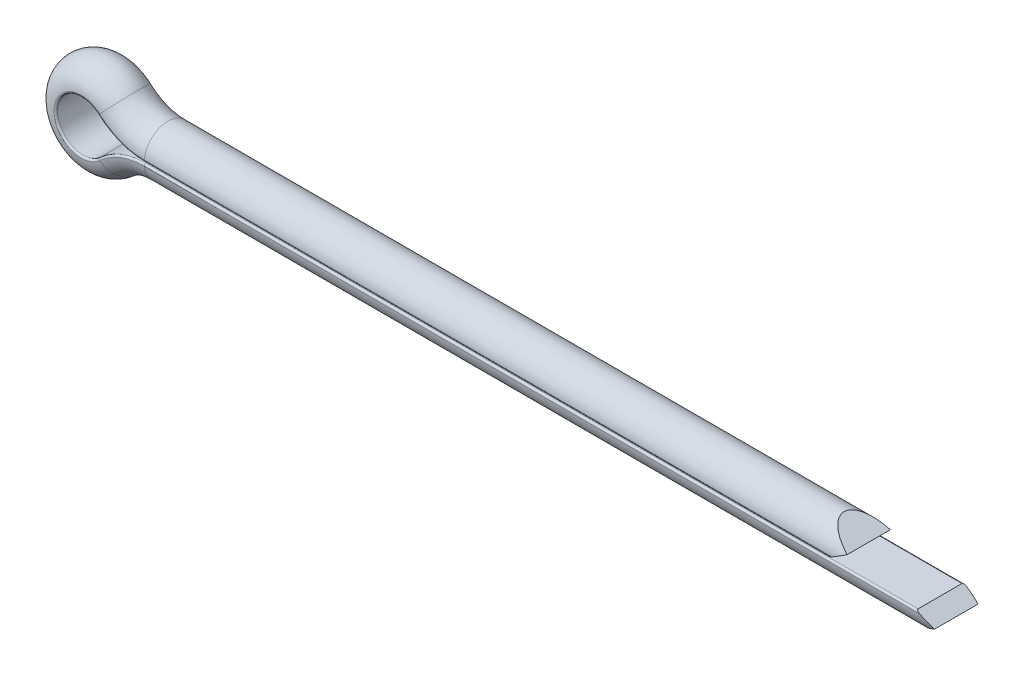
ISO-10303-21;
HEADER;
FILE_DESCRIPTION(('STEP AP214'),'2;1');
FILE_NAME('part.step','',(''),(''),'','','');
FILE_SCHEMA(('AUTOMOTIVE_DESIGN { 1 0 10303 214 1 1 1 1 }'));
ENDSEC;
DATA;
#1=APPLICATION_CONTEXT('core data for automotive mechanical design processes');
#2=APPLICATION_PROTOCOL_DEFINITION('international standard','automotive_design',2000,#1);
#3=PRODUCT_CONTEXT('',#1,'mechanical');
#4=PRODUCT('Part','Part','',(#3));
#5=PRODUCT_RELATED_PRODUCT_CATEGORY('part','',(#4));
#6=PRODUCT_DEFINITION_FORMATION('','',#4);
#7=PRODUCT_DEFINITION_CONTEXT('part definition',#1,'design');
#8=PRODUCT_DEFINITION('design','',#6,#7);
#9=PRODUCT_DEFINITION_SHAPE('','',#8);
#10=(LENGTH_UNIT() NAMED_UNIT(*) SI_UNIT(.MILLI.,.METRE.));
#11=(NAMED_UNIT(*) PLANE_ANGLE_UNIT() SI_UNIT($,.RADIAN.));
#12=(NAMED_UNIT(*) SI_UNIT($,.STERADIAN.) SOLID_ANGLE_UNIT());
#13=UNCERTAINTY_MEASURE_WITH_UNIT(LENGTH_MEASURE(1.E-05),#10,'distance_accuracy_value','');
#14=(GEOMETRIC_REPRESENTATION_CONTEXT(3) GLOBAL_UNCERTAINTY_ASSIGNED_CONTEXT((#13)) GLOBAL_UNIT_ASSIGNED_CONTEXT((#10,
#11,#12)) REPRESENTATION_CONTEXT('',''));
#15=CARTESIAN_POINT('',(0.,0.,0.));
#16=DIRECTION('',(0.,0.,1.));
#17=DIRECTION('',(1.,0.,0.));
#18=AXIS2_PLACEMENT_3D('',#15,#16,#17);
#19=CARTESIAN_POINT('',(21.8,0.0249999999999998,0.));
#20=DIRECTION('',(-1.,0.,0.));
#21=DIRECTION('',(0.,0.,1.));
#22=AXIS2_PLACEMENT_3D('',#19,#20,#21);
#23=CYLINDRICAL_SURFACE('',#22,0.675);
#24=CARTESIAN_POINT('',(1.8,0.0249999999999998,0.));
#25=DIRECTION('',(1.,0.,0.));
#26=DIRECTION('',(0.,0.,1.));
#27=AXIS2_PLACEMENT_3D('',#24,#25,#26);
#28=CIRCLE('',#27,0.675);
#29=CARTESIAN_POINT('',(1.8,0.0789999999999996,-0.672836532896364));
#30=VERTEX_POINT('',#29);
#31=CARTESIAN_POINT('',(1.8,0.0789999999999996,0.672836532896364));
#32=VERTEX_POINT('',#31);
#33=EDGE_CURVE('E173',#30,#32,#28,.T.);
#34=ORIENTED_EDGE('',*,*,#33,.T.);
#35=DIRECTION('',(-1.,0.,0.));
#36=VECTOR('',#35,1.);
#37=CARTESIAN_POINT('',(21.8,0.0789999999999996,0.672836532896364));
#38=LINE('',#37,#36);
#39=CARTESIAN_POINT('',(21.4258770255651,0.0789999999999993,0.672836532896364));
#40=VERTEX_POINT('',#39);
#41=EDGE_CURVE('E51',#32,#40,#38,.F.);
#42=ORIENTED_EDGE('',*,*,#41,.T.);
#43=CARTESIAN_POINT('',(21.3323462819564,0.0249999999999998,0.));
#44=DIRECTION('',(-0.500000000000001,0.866025403784438,0.));
#45=DIRECTION('',(-0.866025403784438,-0.500000000000002,0.));
#46=AXIS2_PLACEMENT_3D('',#43,#44,#45);
#47=ELLIPSE('',#46,1.35,0.675);
#48=CARTESIAN_POINT('',(21.8,0.295,0.618647718819038));
#49=VERTEX_POINT('',#48);
#50=EDGE_CURVE('E172',#40,#49,#47,.T.);
#51=ORIENTED_EDGE('',*,*,#50,.T.);
#52=CARTESIAN_POINT('',(22.2676537180436,0.0249999999999998,0.));
#53=DIRECTION('',(-0.499999999999994,-0.866025403784442,0.));
#54=DIRECTION('',(-0.866025403784442,0.499999999999994,0.));
#55=AXIS2_PLACEMENT_3D('',#52,#53,#54);
#56=ELLIPSE('',#55,1.35000000000002,0.675);
#57=CARTESIAN_POINT('',(21.8,0.295,-0.618647718819039));
#58=VERTEX_POINT('',#57);
#59=EDGE_CURVE('E156',#49,#58,#56,.T.);
#60=ORIENTED_EDGE('',*,*,#59,.T.);
#61=CARTESIAN_POINT('',(21.4258770255651,0.0789999999999993,-0.672836532896364));
#62=VERTEX_POINT('',#61);
#63=EDGE_CURVE('E170',#58,#62,#47,.T.);
#64=ORIENTED_EDGE('',*,*,#63,.T.);
#65=DIRECTION('',(-1.,0.,0.));
#66=VECTOR('',#65,1.);
#67=CARTESIAN_POINT('',(21.8,0.0789999999999996,-0.672836532896364));
#68=LINE('',#67,#66);
#69=EDGE_CURVE('E236',#62,#30,#68,.T.);
#70=ORIENTED_EDGE('',*,*,#69,.T.);
#71=EDGE_LOOP('',(#34,#42,#51,#60,#64,#70));
#72=FACE_BOUND('',#71,.T.);
#73=ADVANCED_FACE('F34',(#72),#23,.T.);
#74=CARTESIAN_POINT('',(21.8,0.0249999999999996,-0.675));
#75=DIRECTION('',(0.,1.,0.));
#76=DIRECTION('',(0.,0.,1.));
#77=AXIS2_PLACEMENT_3D('',#74,#75,#76);
#78=PLANE('',#77);
#79=DIRECTION('',(0.,0.,1.));
#80=VECTOR('',#79,1.);
#81=CARTESIAN_POINT('',(21.3323462819564,0.0249999999999996,-0.675));
#82=LINE('',#81,#80);
#83=CARTESIAN_POINT('',(21.3323462819564,0.0249999999999996,-0.622996789718856));
#84=VERTEX_POINT('',#83);
#85=CARTESIAN_POINT('',(21.3323462819564,0.0249999999999996,0.622996789718855));
#86=VERTEX_POINT('',#85);
#87=EDGE_CURVE('E150',#84,#86,#82,.T.);
#88=ORIENTED_EDGE('',*,*,#87,.T.);
#89=DIRECTION('',(-1.,0.,0.));
#90=VECTOR('',#89,1.);
#91=CARTESIAN_POINT('',(21.8,0.0249999999999996,0.622996789718856));
#92=LINE('',#91,#90);
#93=CARTESIAN_POINT('',(1.8,0.0249999999999996,0.622996789718855));
#94=VERTEX_POINT('',#93);
#95=EDGE_CURVE('E234',#86,#94,#92,.T.);
#96=ORIENTED_EDGE('',*,*,#95,.T.);
#97=DIRECTION('',(0.,0.,-1.));
#98=VECTOR('',#97,1.);
#99=CARTESIAN_POINT('',(1.8,0.0249999999999996,-0.675));
#100=LINE('',#99,#98);
#101=CARTESIAN_POINT('',(1.8,0.0249999999999996,-0.622996789718856));
#102=VERTEX_POINT('',#101);
#103=EDGE_CURVE('E175',#94,#102,#100,.T.);
#104=ORIENTED_EDGE('',*,*,#103,.T.);
#105=DIRECTION('',(-1.,0.,0.));
#106=VECTOR('',#105,1.);
#107=CARTESIAN_POINT('',(21.8,0.0249999999999996,-0.622996789718856));
#108=LINE('',#107,#106);
#109=EDGE_CURVE('E232',#102,#84,#108,.F.);
#110=ORIENTED_EDGE('',*,*,#109,.T.);
#111=EDGE_LOOP('',(#88,#96,#104,#110));
#112=FACE_BOUND('',#111,.T.);
#113=ADVANCED_FACE('F273',(#112),#78,.F.);
#114=CARTESIAN_POINT('',(1.8,1.96428571428572,0.));
#115=DIRECTION('',(0.,0.,-1.));
#116=DIRECTION('',(-1.,0.,0.));
#117=AXIS2_PLACEMENT_3D('',#114,#115,#116);
#118=TOROIDAL_SURFACE('',#117,1.93928571428572,0.675);
#119=CARTESIAN_POINT('',(0.489812332439676,0.534517426273459,0.));
#120=DIRECTION('',(0.737265415549598,-0.675603217158177,0.));
#121=DIRECTION('',(0.,0.,1.));
#122=AXIS2_PLACEMENT_3D('',#119,#120,#121);
#123=CIRCLE('',#122,0.675);
#124=CARTESIAN_POINT('',(0.526294906166815,0.57432975871379,-0.672836532896221));
#125=VERTEX_POINT('',#124);
#126=CARTESIAN_POINT('',(0.526294906166792,0.574329758713765,0.672836532896226));
#127=VERTEX_POINT('',#126);
#128=EDGE_CURVE('E176',#125,#127,#123,.T.);
#129=ORIENTED_EDGE('',*,*,#128,.T.);
#130=CARTESIAN_POINT('',(1.8,1.96428571428572,0.672836532896226));
#131=DIRECTION('',(0.,0.,-1.));
#132=DIRECTION('',(-1.,0.,0.));
#133=AXIS2_PLACEMENT_3D('',#130,#131,#132);
#134=CIRCLE('',#133,1.88528571428573);
#135=EDGE_CURVE('E230',#127,#32,#134,.F.);
#136=ORIENTED_EDGE('',*,*,#135,.T.);
#137=ORIENTED_EDGE('',*,*,#33,.F.);
#138=CARTESIAN_POINT('',(1.8,1.96428571428572,-0.672836532896221));
#139=DIRECTION('',(0.,0.,1.));
#140=DIRECTION('',(1.,0.,0.));
#141=AXIS2_PLACEMENT_3D('',#138,#139,#140);
#142=CIRCLE('',#141,1.88528571428573);
#143=EDGE_CURVE('E228',#30,#125,#142,.F.);
#144=ORIENTED_EDGE('',*,*,#143,.T.);
#145=EDGE_LOOP('',(#129,#136,#137,#144));
#146=FACE_BOUND('',#145,.T.);
#147=ADVANCED_FACE('F350',(#146),#118,.T.);
#148=CARTESIAN_POINT('',(1.8,1.96428571428572,0.));
#149=DIRECTION('',(0.,0.,-1.));
#150=DIRECTION('',(-1.,0.,0.));
#151=AXIS2_PLACEMENT_3D('',#148,#149,#150);
#152=CYLINDRICAL_SURFACE('',#151,1.93928571428572);
#153=ORIENTED_EDGE('',*,*,#103,.F.);
#154=CARTESIAN_POINT('',(1.8,1.96428571428572,0.622996789718856));
#155=DIRECTION('',(0.,0.,1.));
#156=DIRECTION('',(1.,0.,0.));
#157=AXIS2_PLACEMENT_3D('',#154,#155,#156);
#158=CIRCLE('',#157,1.93928571428572);
#159=CARTESIAN_POINT('',(0.489812332439676,0.534517426273459,0.622996789718855));
#160=VERTEX_POINT('',#159);
#161=EDGE_CURVE('E226',#94,#160,#158,.F.);
#162=ORIENTED_EDGE('',*,*,#161,.T.);
#163=DIRECTION('',(0.,0.,-1.));
#164=VECTOR('',#163,1.);
#165=CARTESIAN_POINT('',(0.489812332439676,0.534517426273459,-0.675));
#166=LINE('',#165,#164);
#167=CARTESIAN_POINT('',(0.489812332439676,0.534517426273459,-0.622996789718856));
#168=VERTEX_POINT('',#167);
#169=EDGE_CURVE('E179',#160,#168,#166,.T.);
#170=ORIENTED_EDGE('',*,*,#169,.T.);
#171=CARTESIAN_POINT('',(1.8,1.96428571428572,-0.622996789718856));
#172=DIRECTION('',(0.,0.,1.));
#173=DIRECTION('',(1.,0.,0.));
#174=AXIS2_PLACEMENT_3D('',#171,#172,#173);
#175=CIRCLE('',#174,1.93928571428572);
#176=EDGE_CURVE('E224',#168,#102,#175,.T.);
#177=ORIENTED_EDGE('',*,*,#176,.T.);
#178=EDGE_LOOP('',(#153,#162,#170,#177));
#179=FACE_BOUND('',#178,.T.);
#180=ADVANCED_FACE('F283',(#179),#152,.T.);
#181=CARTESIAN_POINT('',(0.,0.,0.));
#182=DIRECTION('',(0.,0.,1.));
#183=DIRECTION('',(1.,0.,0.));
#184=AXIS2_PLACEMENT_3D('',#181,#182,#183);
#185=TOROIDAL_SURFACE('',#184,0.725,0.675);
#186=CARTESIAN_POINT('',(0.489812332439676,-0.534517426273459,0.));
#187=DIRECTION('',(-0.737265415549598,-0.675603217158177,0.));
#188=DIRECTION('',(0.,0.,1.));
#189=AXIS2_PLACEMENT_3D('',#186,#187,#188);
#190=CIRCLE('',#189,0.675);
#191=CARTESIAN_POINT('',(0.526294906166266,-0.574329758713191,-0.672836532896352));
#192=VERTEX_POINT('',#191);
#193=CARTESIAN_POINT('',(0.526294906166212,-0.574329758713132,0.672836532896365));
#194=VERTEX_POINT('',#193);
#195=EDGE_CURVE('E180',#192,#194,#190,.T.);
#196=ORIENTED_EDGE('',*,*,#195,.T.);
#197=CARTESIAN_POINT('',(0.,0.,0.672836532896365));
#198=DIRECTION('',(0.,0.,-1.));
#199=DIRECTION('',(-1.,0.,0.));
#200=AXIS2_PLACEMENT_3D('',#197,#198,#199);
#201=CIRCLE('',#200,0.779);
#202=EDGE_CURVE('E222',#194,#127,#201,.T.);
#203=ORIENTED_EDGE('',*,*,#202,.T.);
#204=ORIENTED_EDGE('',*,*,#128,.F.);
#205=CARTESIAN_POINT('',(0.,0.,-0.672836532896352));
#206=DIRECTION('',(0.,0.,1.));
#207=DIRECTION('',(1.,0.,0.));
#208=AXIS2_PLACEMENT_3D('',#205,#206,#207);
#209=CIRCLE('',#208,0.778999999999999);
#210=EDGE_CURVE('E220',#125,#192,#209,.T.);
#211=ORIENTED_EDGE('',*,*,#210,.T.);
#212=EDGE_LOOP('',(#196,#203,#204,#211));
#213=FACE_BOUND('',#212,.T.);
#214=ADVANCED_FACE('F322',(#213),#185,.T.);
#215=CARTESIAN_POINT('',(0.,0.,0.));
#216=DIRECTION('',(0.,0.,1.));
#217=DIRECTION('',(1.,0.,0.));
#218=AXIS2_PLACEMENT_3D('',#215,#216,#217);
#219=CYLINDRICAL_SURFACE('',#218,0.725);
#220=ORIENTED_EDGE('',*,*,#169,.F.);
#221=CARTESIAN_POINT('',(0.,0.,0.622996789718856));
#222=DIRECTION('',(0.,0.,-1.));
#223=DIRECTION('',(-1.,0.,0.));
#224=AXIS2_PLACEMENT_3D('',#221,#222,#223);
#225=CIRCLE('',#224,0.725);
#226=CARTESIAN_POINT('',(0.489812332439676,-0.534517426273459,0.622996789718855));
#227=VERTEX_POINT('',#226);
#228=EDGE_CURVE('E218',#160,#227,#225,.F.);
#229=ORIENTED_EDGE('',*,*,#228,.T.);
#230=DIRECTION('',(0.,0.,-1.));
#231=VECTOR('',#230,1.);
#232=CARTESIAN_POINT('',(0.489812332439676,-0.534517426273459,-0.675));
#233=LINE('',#232,#231);
#234=CARTESIAN_POINT('',(0.489812332439676,-0.534517426273459,-0.622996789718856));
#235=VERTEX_POINT('',#234);
#236=EDGE_CURVE('E183',#227,#235,#233,.T.);
#237=ORIENTED_EDGE('',*,*,#236,.T.);
#238=CARTESIAN_POINT('',(0.,0.,-0.622996789718856));
#239=DIRECTION('',(0.,0.,-1.));
#240=DIRECTION('',(-1.,0.,0.));
#241=AXIS2_PLACEMENT_3D('',#238,#239,#240);
#242=CIRCLE('',#241,0.725);
#243=EDGE_CURVE('E216',#235,#168,#242,.T.);
#244=ORIENTED_EDGE('',*,*,#243,.T.);
#245=EDGE_LOOP('',(#220,#229,#237,#244));
#246=FACE_BOUND('',#245,.T.);
#247=ADVANCED_FACE('F287',(#246),#219,.F.);
#248=CARTESIAN_POINT('',(1.8,-1.96428571428572,0.));
#249=DIRECTION('',(0.,0.,-1.));
#250=DIRECTION('',(-1.,0.,0.));
#251=AXIS2_PLACEMENT_3D('',#248,#249,#250);
#252=TOROIDAL_SURFACE('',#251,1.93928571428572,0.675);
#253=CARTESIAN_POINT('',(1.8,-0.0249999999999998,0.));
#254=DIRECTION('',(-1.,0.,0.));
#255=DIRECTION('',(0.,0.,1.));
#256=AXIS2_PLACEMENT_3D('',#253,#254,#255);
#257=CIRCLE('',#256,0.675);
#258=CARTESIAN_POINT('',(1.8,-0.0790000000008683,-0.672836532896224));
#259=VERTEX_POINT('',#258);
#260=CARTESIAN_POINT('',(1.8,-0.0790000000013898,0.672836532896139));
#261=VERTEX_POINT('',#260);
#262=EDGE_CURVE('E184',#259,#261,#257,.T.);
#263=ORIENTED_EDGE('',*,*,#262,.T.);
#264=CARTESIAN_POINT('',(1.8,-1.96428571428572,0.672836532896139));
#265=DIRECTION('',(0.,0.,-1.));
#266=DIRECTION('',(-1.,0.,0.));
#267=AXIS2_PLACEMENT_3D('',#264,#265,#266);
#268=CIRCLE('',#267,1.88528571428573);
#269=EDGE_CURVE('E214',#261,#194,#268,.F.);
#270=ORIENTED_EDGE('',*,*,#269,.T.);
#271=ORIENTED_EDGE('',*,*,#195,.F.);
#272=CARTESIAN_POINT('',(1.8,-1.96428571428572,-0.672836532896224));
#273=DIRECTION('',(0.,0.,1.));
#274=DIRECTION('',(1.,0.,0.));
#275=AXIS2_PLACEMENT_3D('',#272,#273,#274);
#276=CIRCLE('',#275,1.88528571428573);
#277=EDGE_CURVE('E212',#192,#259,#276,.F.);
#278=ORIENTED_EDGE('',*,*,#277,.T.);
#279=EDGE_LOOP('',(#263,#270,#271,#278));
#280=FACE_BOUND('',#279,.T.);
#281=ADVANCED_FACE('F324',(#280),#252,.T.);
#282=CARTESIAN_POINT('',(1.8,-1.96428571428572,0.));
#283=DIRECTION('',(0.,0.,-1.));
#284=DIRECTION('',(-1.,0.,0.));
#285=AXIS2_PLACEMENT_3D('',#282,#283,#284);
#286=CYLINDRICAL_SURFACE('',#285,1.93928571428572);
#287=ORIENTED_EDGE('',*,*,#236,.F.);
#288=CARTESIAN_POINT('',(1.8,-1.96428571428572,0.622996789718856));
#289=DIRECTION('',(0.,0.,1.));
#290=DIRECTION('',(1.,0.,0.));
#291=AXIS2_PLACEMENT_3D('',#288,#289,#290);
#292=CIRCLE('',#291,1.93928571428572);
#293=CARTESIAN_POINT('',(1.8,-0.0249999999999996,0.622996789718855));
#294=VERTEX_POINT('',#293);
#295=EDGE_CURVE('E210',#227,#294,#292,.F.);
#296=ORIENTED_EDGE('',*,*,#295,.T.);
#297=DIRECTION('',(0.,0.,-1.));
#298=VECTOR('',#297,1.);
#299=CARTESIAN_POINT('',(1.8,-0.0249999999999996,-0.675));
#300=LINE('',#299,#298);
#301=CARTESIAN_POINT('',(1.8,-0.0249999999999996,-0.622996789718856));
#302=VERTEX_POINT('',#301);
#303=EDGE_CURVE('E157',#294,#302,#300,.T.);
#304=ORIENTED_EDGE('',*,*,#303,.T.);
#305=CARTESIAN_POINT('',(1.8,-1.96428571428572,-0.622996789718856));
#306=DIRECTION('',(0.,0.,1.));
#307=DIRECTION('',(1.,0.,0.));
#308=AXIS2_PLACEMENT_3D('',#305,#306,#307);
#309=CIRCLE('',#308,1.93928571428572);
#310=EDGE_CURVE('E208',#302,#235,#309,.T.);
#311=ORIENTED_EDGE('',*,*,#310,.T.);
#312=EDGE_LOOP('',(#287,#296,#304,#311));
#313=FACE_BOUND('',#312,.T.);
#314=ADVANCED_FACE('F305',(#313),#286,.T.);
#315=CARTESIAN_POINT('',(1.8,-0.0249999999999998,0.));
#316=DIRECTION('',(1.,0.,0.));
#317=DIRECTION('',(0.,0.,-1.));
#318=AXIS2_PLACEMENT_3D('',#315,#316,#317);
#319=CYLINDRICAL_SURFACE('',#318,0.675);
#320=CARTESIAN_POINT('',(23.8323462819564,-0.0249999999999998,0.));
#321=DIRECTION('',(-0.500000000000002,-0.866025403784438,0.));
#322=DIRECTION('',(0.866025403784438,-0.500000000000002,0.));
#323=AXIS2_PLACEMENT_3D('',#320,#321,#322);
#324=ELLIPSE('',#323,1.35,0.675);
#325=CARTESIAN_POINT('',(24.3,-0.294999999999999,0.618647718819039));
#326=VERTEX_POINT('',#325);
#327=CARTESIAN_POINT('',(23.9258770255651,-0.0789999999999992,0.672836532896364));
#328=VERTEX_POINT('',#327);
#329=EDGE_CURVE('E149',#326,#328,#324,.T.);
#330=ORIENTED_EDGE('',*,*,#329,.T.);
#331=DIRECTION('',(1.,0.,0.));
#332=VECTOR('',#331,1.);
#333=CARTESIAN_POINT('',(1.8,-0.0789999999999996,0.672836532896364));
#334=LINE('',#333,#332);
#335=EDGE_CURVE('E206',#328,#261,#334,.F.);
#336=ORIENTED_EDGE('',*,*,#335,.T.);
#337=ORIENTED_EDGE('',*,*,#262,.F.);
#338=DIRECTION('',(1.,0.,0.));
#339=VECTOR('',#338,1.);
#340=CARTESIAN_POINT('',(1.8,-0.0789999999999996,-0.672836532896364));
#341=LINE('',#340,#339);
#342=CARTESIAN_POINT('',(23.9258770255651,-0.078999999999999,-0.672836532896364));
#343=VERTEX_POINT('',#342);
#344=EDGE_CURVE('E146',#259,#343,#341,.T.);
#345=ORIENTED_EDGE('',*,*,#344,.T.);
#346=CARTESIAN_POINT('',(24.3,-0.294999999999999,-0.618647718819039));
#347=VERTEX_POINT('',#346);
#348=EDGE_CURVE('E138',#343,#347,#324,.T.);
#349=ORIENTED_EDGE('',*,*,#348,.T.);
#350=CARTESIAN_POINT('',(24.7676537180436,-0.0249999999999998,0.));
#351=DIRECTION('',(-0.499999999999994,0.866025403784442,0.));
#352=DIRECTION('',(0.866025403784442,0.499999999999994,0.));
#353=AXIS2_PLACEMENT_3D('',#350,#351,#352);
#354=ELLIPSE('',#353,1.35000000000002,0.675);
#355=EDGE_CURVE('E142',#347,#326,#354,.T.);
#356=ORIENTED_EDGE('',*,*,#355,.T.);
#357=EDGE_LOOP('',(#330,#336,#337,#345,#349,#356));
#358=FACE_BOUND('',#357,.T.);
#359=ADVANCED_FACE('F141',(#358),#319,.T.);
#360=CARTESIAN_POINT('',(1.8,-0.0249999999999996,-0.675));
#361=DIRECTION('',(0.,-1.,0.));
#362=DIRECTION('',(0.,0.,-1.));
#363=AXIS2_PLACEMENT_3D('',#360,#361,#362);
#364=PLANE('',#363);
#365=ORIENTED_EDGE('',*,*,#303,.F.);
#366=DIRECTION('',(1.,0.,0.));
#367=VECTOR('',#366,1.);
#368=CARTESIAN_POINT('',(1.8,-0.0249999999999996,0.622996789718855));
#369=LINE('',#368,#367);
#370=CARTESIAN_POINT('',(23.8323462819564,-0.0249999999999994,0.622996789718855));
#371=VERTEX_POINT('',#370);
#372=EDGE_CURVE('E198',#294,#371,#369,.T.);
#373=ORIENTED_EDGE('',*,*,#372,.T.);
#374=DIRECTION('',(0.,0.,1.));
#375=VECTOR('',#374,1.);
#376=CARTESIAN_POINT('',(23.8323462819564,-0.0249999999999994,-0.675));
#377=LINE('',#376,#375);
#378=CARTESIAN_POINT('',(23.8323462819564,-0.0249999999999994,-0.622996789718856));
#379=VERTEX_POINT('',#378);
#380=EDGE_CURVE('E162',#379,#371,#377,.T.);
#381=ORIENTED_EDGE('',*,*,#380,.F.);
#382=DIRECTION('',(1.,0.,0.));
#383=VECTOR('',#382,1.);
#384=CARTESIAN_POINT('',(1.8,-0.0249999999999996,-0.622996789718856));
#385=LINE('',#384,#383);
#386=EDGE_CURVE('E196',#379,#302,#385,.F.);
#387=ORIENTED_EDGE('',*,*,#386,.T.);
#388=EDGE_LOOP('',(#365,#373,#381,#387));
#389=FACE_BOUND('',#388,.T.);
#390=ADVANCED_FACE('F308',(#389),#364,.F.);
#391=CARTESIAN_POINT('',(24.3,-0.294999999999999,-0.675));
#392=DIRECTION('',(-0.500000000000002,-0.866025403784438,0.));
#393=DIRECTION('',(0.866025403784438,-0.500000000000002,0.));
#394=AXIS2_PLACEMENT_3D('',#391,#392,#393);
#395=PLANE('',#394);
#396=ORIENTED_EDGE('',*,*,#380,.T.);
#397=CARTESIAN_POINT('',(23.9189488223348,-0.0749999999999996,0.622996789718856));
#398=DIRECTION('',(-0.500000000000002,-0.866025403784438,0.));
#399=DIRECTION('',(0.866025403784438,-0.500000000000002,0.));
#400=AXIS2_PLACEMENT_3D('',#397,#398,#399);
#401=ELLIPSE('',#400,0.0999999999999997,0.05);
#402=EDGE_CURVE('E203',#371,#328,#401,.F.);
#403=ORIENTED_EDGE('',*,*,#402,.T.);
#404=ORIENTED_EDGE('',*,*,#329,.F.);
#405=DIRECTION('',(0.,0.,1.));
#406=VECTOR('',#405,1.);
#407=CARTESIAN_POINT('',(24.3,-0.294999999999999,-0.675));
#408=LINE('',#407,#406);
#409=EDGE_CURVE('E155',#347,#326,#408,.T.);
#410=ORIENTED_EDGE('',*,*,#409,.F.);
#411=ORIENTED_EDGE('',*,*,#348,.F.);
#412=CARTESIAN_POINT('',(23.9189488223348,-0.0749999999999996,-0.622996789718856));
#413=DIRECTION('',(-0.500000000000002,-0.866025403784438,0.));
#414=DIRECTION('',(0.866025403784438,-0.500000000000002,0.));
#415=AXIS2_PLACEMENT_3D('',#412,#413,#414);
#416=ELLIPSE('',#415,0.0999999999999997,0.05);
#417=EDGE_CURVE('E201',#343,#379,#416,.F.);
#418=ORIENTED_EDGE('',*,*,#417,.T.);
#419=EDGE_LOOP('',(#396,#403,#404,#410,#411,#418));
#420=FACE_BOUND('',#419,.T.);
#421=ADVANCED_FACE('F160',(#420),#395,.F.);
#422=CARTESIAN_POINT('',(23.5985194229346,-0.7,-0.675));
#423=DIRECTION('',(-0.499999999999994,0.866025403784442,0.));
#424=DIRECTION('',(-0.866025403784442,-0.499999999999994,0.));
#425=AXIS2_PLACEMENT_3D('',#422,#423,#424);
#426=PLANE('',#425);
#427=ORIENTED_EDGE('',*,*,#409,.T.);
#428=ORIENTED_EDGE('',*,*,#355,.F.);
#429=EDGE_LOOP('',(#427,#428));
#430=FACE_BOUND('',#429,.T.);
#431=ADVANCED_FACE('F154',(#430),#426,.F.);
#432=CARTESIAN_POINT('',(21.8,0.295,-0.675));
#433=DIRECTION('',(-0.499999999999994,-0.866025403784442,0.));
#434=DIRECTION('',(0.866025403784442,-0.499999999999994,0.));
#435=AXIS2_PLACEMENT_3D('',#432,#433,#434);
#436=PLANE('',#435);
#437=ORIENTED_EDGE('',*,*,#59,.F.);
#438=DIRECTION('',(0.,0.,1.));
#439=VECTOR('',#438,1.);
#440=CARTESIAN_POINT('',(21.8,0.295,-0.675));
#441=LINE('',#440,#439);
#442=EDGE_CURVE('E161',#58,#49,#441,.T.);
#443=ORIENTED_EDGE('',*,*,#442,.F.);
#444=EDGE_LOOP('',(#437,#443));
#445=FACE_BOUND('',#444,.T.);
#446=ADVANCED_FACE('F364',(#445),#436,.F.);
#447=CARTESIAN_POINT('',(21.3323462819564,0.0249999999999996,-0.675));
#448=DIRECTION('',(-0.500000000000001,0.866025403784438,0.));
#449=DIRECTION('',(-0.866025403784438,-0.500000000000002,0.));
#450=AXIS2_PLACEMENT_3D('',#447,#448,#449);
#451=PLANE('',#450);
#452=ORIENTED_EDGE('',*,*,#50,.F.);
#453=CARTESIAN_POINT('',(21.4189488223349,0.0749999999999996,0.622996789718856));
#454=DIRECTION('',(-0.500000000000001,0.866025403784438,0.));
#455=DIRECTION('',(-0.866025403784438,-0.500000000000002,0.));
#456=AXIS2_PLACEMENT_3D('',#453,#454,#455);
#457=ELLIPSE('',#456,0.0999999999999997,0.05);
#458=EDGE_CURVE('E11',#40,#86,#457,.F.);
#459=ORIENTED_EDGE('',*,*,#458,.T.);
#460=ORIENTED_EDGE('',*,*,#87,.F.);
#461=CARTESIAN_POINT('',(21.4189488223349,0.0749999999999996,-0.622996789718856));
#462=DIRECTION('',(-0.500000000000001,0.866025403784438,0.));
#463=DIRECTION('',(-0.866025403784438,-0.500000000000002,0.));
#464=AXIS2_PLACEMENT_3D('',#461,#462,#463);
#465=ELLIPSE('',#464,0.0999999999999997,0.05);
#466=EDGE_CURVE('E43',#84,#62,#465,.F.);
#467=ORIENTED_EDGE('',*,*,#466,.T.);
#468=ORIENTED_EDGE('',*,*,#63,.F.);
#469=ORIENTED_EDGE('',*,*,#442,.T.);
#470=EDGE_LOOP('',(#452,#459,#460,#467,#468,#469));
#471=FACE_BOUND('',#470,.T.);
#472=ADVANCED_FACE('F276',(#471),#451,.F.);
#473=CARTESIAN_POINT('',(21.8,0.0749999999999996,0.622996789718856));
#474=DIRECTION('',(-1.,0.,0.));
#475=DIRECTION('',(0.,0.,1.));
#476=AXIS2_PLACEMENT_3D('',#473,#474,#475);
#477=CYLINDRICAL_SURFACE('',#476,0.05);
#478=ORIENTED_EDGE('',*,*,#458,.F.);
#479=ORIENTED_EDGE('',*,*,#41,.F.);
#480=CARTESIAN_POINT('',(1.8,0.0749999999999996,0.622996789718856));
#481=DIRECTION('',(-1.,0.,0.));
#482=DIRECTION('',(0.,0.,1.));
#483=AXIS2_PLACEMENT_3D('',#480,#481,#482);
#484=CIRCLE('',#483,0.05);
#485=EDGE_CURVE('E166',#94,#32,#484,.T.);
#486=ORIENTED_EDGE('',*,*,#485,.F.);
#487=ORIENTED_EDGE('',*,*,#95,.F.);
#488=EDGE_LOOP('',(#478,#479,#486,#487));
#489=FACE_BOUND('',#488,.T.);
#490=ADVANCED_FACE('F279',(#489),#477,.T.);
#491=CARTESIAN_POINT('',(1.8,1.96428571428572,0.622996789718856));
#492=DIRECTION('',(0.,0.,1.));
#493=DIRECTION('',(1.,0.,0.));
#494=AXIS2_PLACEMENT_3D('',#491,#492,#493);
#495=TOROIDAL_SURFACE('',#494,1.88928571428572,0.05);
#496=ORIENTED_EDGE('',*,*,#485,.T.);
#497=ORIENTED_EDGE('',*,*,#135,.F.);
#498=CARTESIAN_POINT('',(0.523592493297583,0.571380697050937,0.622996789718856));
#499=DIRECTION('',(-0.737265415549598,0.675603217158177,0.));
#500=DIRECTION('',(-0.675603217158177,-0.737265415549598,0.));
#501=AXIS2_PLACEMENT_3D('',#498,#499,#500);
#502=CIRCLE('',#501,0.05);
#503=EDGE_CURVE('E246',#160,#127,#502,.T.);
#504=ORIENTED_EDGE('',*,*,#503,.F.);
#505=ORIENTED_EDGE('',*,*,#161,.F.);
#506=EDGE_LOOP('',(#496,#497,#504,#505));
#507=FACE_BOUND('',#506,.T.);
#508=ADVANCED_FACE('F292',(#507),#495,.T.);
#509=CARTESIAN_POINT('',(0.,0.,0.622996789718856));
#510=DIRECTION('',(0.,0.,-1.));
#511=DIRECTION('',(-1.,0.,0.));
#512=AXIS2_PLACEMENT_3D('',#509,#510,#511);
#513=TOROIDAL_SURFACE('',#512,0.775,0.05);
#514=ORIENTED_EDGE('',*,*,#503,.T.);
#515=ORIENTED_EDGE('',*,*,#202,.F.);
#516=CARTESIAN_POINT('',(0.523592493297585,-0.57138069705094,0.622996789718856));
#517=DIRECTION('',(0.7372654155496,0.675603217158175,0.));
#518=DIRECTION('',(-0.675603217158175,0.7372654155496,0.));
#519=AXIS2_PLACEMENT_3D('',#516,#517,#518);
#520=CIRCLE('',#519,0.05);
#521=EDGE_CURVE('E243',#227,#194,#520,.T.);
#522=ORIENTED_EDGE('',*,*,#521,.F.);
#523=ORIENTED_EDGE('',*,*,#228,.F.);
#524=EDGE_LOOP('',(#514,#515,#522,#523));
#525=FACE_BOUND('',#524,.T.);
#526=ADVANCED_FACE('F296',(#525),#513,.T.);
#527=CARTESIAN_POINT('',(1.8,-1.96428571428572,0.622996789718856));
#528=DIRECTION('',(0.,0.,1.));
#529=DIRECTION('',(1.,0.,0.));
#530=AXIS2_PLACEMENT_3D('',#527,#528,#529);
#531=TOROIDAL_SURFACE('',#530,1.88928571428572,0.05);
#532=ORIENTED_EDGE('',*,*,#521,.T.);
#533=ORIENTED_EDGE('',*,*,#269,.F.);
#534=CARTESIAN_POINT('',(1.8,-0.0749999999999988,0.622996789718856));
#535=DIRECTION('',(1.,0.,0.));
#536=DIRECTION('',(0.,0.,-1.));
#537=AXIS2_PLACEMENT_3D('',#534,#535,#536);
#538=CIRCLE('',#537,0.05);
#539=EDGE_CURVE('E240',#294,#261,#538,.T.);
#540=ORIENTED_EDGE('',*,*,#539,.F.);
#541=ORIENTED_EDGE('',*,*,#295,.F.);
#542=EDGE_LOOP('',(#532,#533,#540,#541));
#543=FACE_BOUND('',#542,.T.);
#544=ADVANCED_FACE('F301',(#543),#531,.T.);
#545=CARTESIAN_POINT('',(1.8,-0.0749999999999996,0.622996789718856));
#546=DIRECTION('',(1.,0.,0.));
#547=DIRECTION('',(0.,0.,-1.));
#548=AXIS2_PLACEMENT_3D('',#545,#546,#547);
#549=CYLINDRICAL_SURFACE('',#548,0.05);
#550=ORIENTED_EDGE('',*,*,#539,.T.);
#551=ORIENTED_EDGE('',*,*,#335,.F.);
#552=ORIENTED_EDGE('',*,*,#402,.F.);
#553=ORIENTED_EDGE('',*,*,#372,.F.);
#554=EDGE_LOOP('',(#550,#551,#552,#553));
#555=FACE_BOUND('',#554,.T.);
#556=ADVANCED_FACE('F327',(#555),#549,.T.);
#557=CARTESIAN_POINT('',(21.8,0.0749999999999996,-0.622996789718856));
#558=DIRECTION('',(-1.,0.,0.));
#559=DIRECTION('',(0.,0.,1.));
#560=AXIS2_PLACEMENT_3D('',#557,#558,#559);
#561=CYLINDRICAL_SURFACE('',#560,0.05);
#562=ORIENTED_EDGE('',*,*,#466,.F.);
#563=ORIENTED_EDGE('',*,*,#109,.F.);
#564=CARTESIAN_POINT('',(1.8,0.0749999999999996,-0.622996789718856));
#565=DIRECTION('',(-1.,0.,0.));
#566=DIRECTION('',(0.,0.,1.));
#567=AXIS2_PLACEMENT_3D('',#564,#565,#566);
#568=CIRCLE('',#567,0.05);
#569=EDGE_CURVE('E38',#30,#102,#568,.T.);
#570=ORIENTED_EDGE('',*,*,#569,.F.);
#571=ORIENTED_EDGE('',*,*,#69,.F.);
#572=EDGE_LOOP('',(#562,#563,#570,#571));
#573=FACE_BOUND('',#572,.T.);
#574=ADVANCED_FACE('F36',(#573),#561,.T.);
#575=CARTESIAN_POINT('',(1.8,1.96428571428572,-0.622996789718856));
#576=DIRECTION('',(0.,0.,1.));
#577=DIRECTION('',(1.,0.,0.));
#578=AXIS2_PLACEMENT_3D('',#575,#576,#577);
#579=TOROIDAL_SURFACE('',#578,1.88928571428572,0.05);
#580=ORIENTED_EDGE('',*,*,#569,.T.);
#581=ORIENTED_EDGE('',*,*,#176,.F.);
#582=CARTESIAN_POINT('',(0.523592493297583,0.571380697050937,-0.622996789718856));
#583=DIRECTION('',(-0.737265415549597,0.675603217158177,0.));
#584=DIRECTION('',(-0.675603217158177,-0.737265415549597,0.));
#585=AXIS2_PLACEMENT_3D('',#582,#583,#584);
#586=CIRCLE('',#585,0.05);
#587=EDGE_CURVE('E256',#125,#168,#586,.T.);
#588=ORIENTED_EDGE('',*,*,#587,.F.);
#589=ORIENTED_EDGE('',*,*,#143,.F.);
#590=EDGE_LOOP('',(#580,#581,#588,#589));
#591=FACE_BOUND('',#590,.T.);
#592=ADVANCED_FACE('F267',(#591),#579,.T.);
#593=CARTESIAN_POINT('',(0.,0.,-0.622996789718856));
#594=DIRECTION('',(0.,0.,-1.));
#595=DIRECTION('',(-1.,0.,0.));
#596=AXIS2_PLACEMENT_3D('',#593,#594,#595);
#597=TOROIDAL_SURFACE('',#596,0.775,0.05);
#598=ORIENTED_EDGE('',*,*,#587,.T.);
#599=ORIENTED_EDGE('',*,*,#243,.F.);
#600=CARTESIAN_POINT('',(0.523592493297585,-0.57138069705094,-0.622996789718856));
#601=DIRECTION('',(0.737265415549599,0.675603217158176,0.));
#602=DIRECTION('',(-0.675603217158176,0.737265415549599,0.));
#603=AXIS2_PLACEMENT_3D('',#600,#601,#602);
#604=CIRCLE('',#603,0.05);
#605=EDGE_CURVE('E254',#192,#235,#604,.T.);
#606=ORIENTED_EDGE('',*,*,#605,.F.);
#607=ORIENTED_EDGE('',*,*,#210,.F.);
#608=EDGE_LOOP('',(#598,#599,#606,#607));
#609=FACE_BOUND('',#608,.T.);
#610=ADVANCED_FACE('F318',(#609),#597,.T.);
#611=CARTESIAN_POINT('',(1.8,-1.96428571428572,-0.622996789718856));
#612=DIRECTION('',(0.,0.,1.));
#613=DIRECTION('',(1.,0.,0.));
#614=AXIS2_PLACEMENT_3D('',#611,#612,#613);
#615=TOROIDAL_SURFACE('',#614,1.88928571428572,0.05);
#616=ORIENTED_EDGE('',*,*,#605,.T.);
#617=ORIENTED_EDGE('',*,*,#310,.F.);
#618=CARTESIAN_POINT('',(1.8,-0.0749999999999987,-0.622996789718856));
#619=DIRECTION('',(1.,0.,0.));
#620=DIRECTION('',(0.,0.,-1.));
#621=AXIS2_PLACEMENT_3D('',#618,#619,#620);
#622=CIRCLE('',#621,0.05);
#623=EDGE_CURVE('E251',#259,#302,#622,.T.);
#624=ORIENTED_EDGE('',*,*,#623,.F.);
#625=ORIENTED_EDGE('',*,*,#277,.F.);
#626=EDGE_LOOP('',(#616,#617,#624,#625));
#627=FACE_BOUND('',#626,.T.);
#628=ADVANCED_FACE('F316',(#627),#615,.T.);
#629=CARTESIAN_POINT('',(1.8,-0.0749999999999996,-0.622996789718856));
#630=DIRECTION('',(1.,0.,0.));
#631=DIRECTION('',(0.,0.,-1.));
#632=AXIS2_PLACEMENT_3D('',#629,#630,#631);
#633=CYLINDRICAL_SURFACE('',#632,0.05);
#634=ORIENTED_EDGE('',*,*,#623,.T.);
#635=ORIENTED_EDGE('',*,*,#386,.F.);
#636=ORIENTED_EDGE('',*,*,#417,.F.);
#637=ORIENTED_EDGE('',*,*,#344,.F.);
#638=EDGE_LOOP('',(#634,#635,#636,#637));
#639=FACE_BOUND('',#638,.T.);
#640=ADVANCED_FACE('F312',(#639),#633,.T.);
#641=CLOSED_SHELL('',(#73,#113,#147,#180,#214,#247,#281,#314,#359,#390,#421,#431,#446,#472,#490,
#508,#526,#544,#556,#574,#592,#610,#628,#640));
#642=MANIFOLD_SOLID_BREP('B2',#641);
#643=ADVANCED_BREP_SHAPE_REPRESENTATION('',(#18,#642),#14);
#644=SHAPE_DEFINITION_REPRESENTATION(#9,#643);
ENDSEC;
END-ISO-10303-21;
